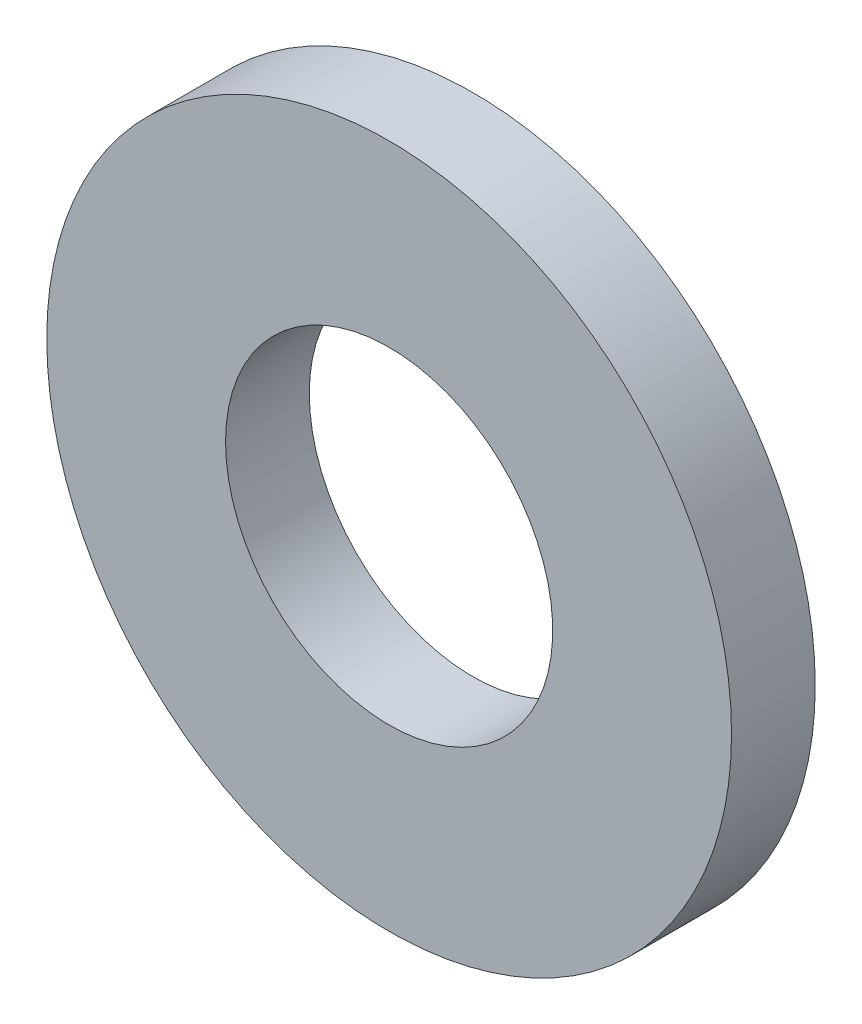
ISO-10303-21;
HEADER;
FILE_DESCRIPTION(('STEP AP214'),'2;1');
FILE_NAME('part.step','',(''),(''),'','','');
FILE_SCHEMA(('AUTOMOTIVE_DESIGN { 1 0 10303 214 1 1 1 1 }'));
ENDSEC;
DATA;
#1=APPLICATION_CONTEXT('core data for automotive mechanical design processes');
#2=APPLICATION_PROTOCOL_DEFINITION('international standard','automotive_design',2000,#1);
#3=PRODUCT_CONTEXT('',#1,'mechanical');
#4=PRODUCT('Part','Part','',(#3));
#5=PRODUCT_RELATED_PRODUCT_CATEGORY('part','',(#4));
#6=PRODUCT_DEFINITION_FORMATION('','',#4);
#7=PRODUCT_DEFINITION_CONTEXT('part definition',#1,'design');
#8=PRODUCT_DEFINITION('design','',#6,#7);
#9=PRODUCT_DEFINITION_SHAPE('','',#8);
#10=(LENGTH_UNIT() NAMED_UNIT(*) SI_UNIT(.MILLI.,.METRE.));
#11=(NAMED_UNIT(*) PLANE_ANGLE_UNIT() SI_UNIT($,.RADIAN.));
#12=(NAMED_UNIT(*) SI_UNIT($,.STERADIAN.) SOLID_ANGLE_UNIT());
#13=UNCERTAINTY_MEASURE_WITH_UNIT(LENGTH_MEASURE(1.E-05),#10,'distance_accuracy_value','');
#14=(GEOMETRIC_REPRESENTATION_CONTEXT(3) GLOBAL_UNCERTAINTY_ASSIGNED_CONTEXT((#13)) GLOBAL_UNIT_ASSIGNED_CONTEXT((#10,
#11,#12)) REPRESENTATION_CONTEXT('',''));
#15=CARTESIAN_POINT('',(0.,0.,0.));
#16=DIRECTION('',(0.,0.,1.));
#17=DIRECTION('',(1.,0.,0.));
#18=AXIS2_PLACEMENT_3D('',#15,#16,#17);
#19=CARTESIAN_POINT('',(0.,0.,0.));
#20=DIRECTION('',(0.,0.,1.));
#21=DIRECTION('',(1.,0.,0.));
#22=AXIS2_PLACEMENT_3D('',#19,#20,#21);
#23=PLANE('',#22);
#24=CARTESIAN_POINT('',(0.,0.,0.));
#25=DIRECTION('',(0.,0.,-1.));
#26=DIRECTION('',(-1.,0.,0.));
#27=AXIS2_PLACEMENT_3D('',#24,#25,#26);
#28=CIRCLE('',#27,2.15);
#29=CARTESIAN_POINT('',(-2.15,0.,0.));
#30=VERTEX_POINT('',#29);
#31=EDGE_CURVE('E27',#30,#30,#28,.F.);
#32=ORIENTED_EDGE('',*,*,#31,.T.);
#33=EDGE_LOOP('',(#32));
#34=FACE_BOUND('',#33,.T.);
#35=CARTESIAN_POINT('',(0.,0.,0.));
#36=DIRECTION('',(0.,0.,-1.));
#37=DIRECTION('',(-1.,0.,0.));
#38=AXIS2_PLACEMENT_3D('',#35,#36,#37);
#39=CIRCLE('',#38,4.5);
#40=CARTESIAN_POINT('',(-4.5,0.,0.));
#41=VERTEX_POINT('',#40);
#42=EDGE_CURVE('E18',#41,#41,#39,.F.);
#43=ORIENTED_EDGE('',*,*,#42,.F.);
#44=EDGE_LOOP('',(#43));
#45=FACE_BOUND('',#44,.T.);
#46=ADVANCED_FACE('F15',(#34,#45),#23,.F.);
#47=CARTESIAN_POINT('',(0.,0.,1.1));
#48=DIRECTION('',(0.,0.,-1.));
#49=DIRECTION('',(-1.,0.,0.));
#50=AXIS2_PLACEMENT_3D('',#47,#48,#49);
#51=CYLINDRICAL_SURFACE('',#50,4.5);
#52=ORIENTED_EDGE('',*,*,#42,.T.);
#53=EDGE_LOOP('',(#52));
#54=FACE_BOUND('',#53,.T.);
#55=CARTESIAN_POINT('',(0.,0.,1.1));
#56=DIRECTION('',(0.,0.,-1.));
#57=DIRECTION('',(-1.,0.,0.));
#58=AXIS2_PLACEMENT_3D('',#55,#56,#57);
#59=CIRCLE('',#58,4.5);
#60=CARTESIAN_POINT('',(-4.5,0.,1.1));
#61=VERTEX_POINT('',#60);
#62=EDGE_CURVE('E22',#61,#61,#59,.F.);
#63=ORIENTED_EDGE('',*,*,#62,.F.);
#64=EDGE_LOOP('',(#63));
#65=FACE_BOUND('',#64,.T.);
#66=ADVANCED_FACE('F35',(#54,#65),#51,.T.);
#67=CARTESIAN_POINT('',(0.,0.,1.1));
#68=DIRECTION('',(0.,0.,-1.));
#69=DIRECTION('',(-1.,0.,0.));
#70=AXIS2_PLACEMENT_3D('',#67,#68,#69);
#71=CYLINDRICAL_SURFACE('',#70,2.15);
#72=CARTESIAN_POINT('',(0.,0.,1.1));
#73=DIRECTION('',(0.,0.,-1.));
#74=DIRECTION('',(-1.,0.,0.));
#75=AXIS2_PLACEMENT_3D('',#72,#73,#74);
#76=CIRCLE('',#75,2.15);
#77=CARTESIAN_POINT('',(-2.15,0.,1.1));
#78=VERTEX_POINT('',#77);
#79=EDGE_CURVE('E10',#78,#78,#76,.T.);
#80=ORIENTED_EDGE('',*,*,#79,.F.);
#81=EDGE_LOOP('',(#80));
#82=FACE_BOUND('',#81,.T.);
#83=ORIENTED_EDGE('',*,*,#31,.F.);
#84=EDGE_LOOP('',(#83));
#85=FACE_BOUND('',#84,.T.);
#86=ADVANCED_FACE('F43',(#82,#85),#71,.F.);
#87=CARTESIAN_POINT('',(0.,0.,1.1));
#88=DIRECTION('',(0.,0.,1.));
#89=DIRECTION('',(1.,0.,0.));
#90=AXIS2_PLACEMENT_3D('',#87,#88,#89);
#91=PLANE('',#90);
#92=ORIENTED_EDGE('',*,*,#79,.T.);
#93=EDGE_LOOP('',(#92));
#94=FACE_BOUND('',#93,.T.);
#95=ORIENTED_EDGE('',*,*,#62,.T.);
#96=EDGE_LOOP('',(#95));
#97=FACE_BOUND('',#96,.T.);
#98=ADVANCED_FACE('F44',(#94,#97),#91,.T.);
#99=CLOSED_SHELL('',(#46,#66,#86,#98));
#100=MANIFOLD_SOLID_BREP('B1',#99);
#101=ADVANCED_BREP_SHAPE_REPRESENTATION('',(#18,#100),#14);
#102=SHAPE_DEFINITION_REPRESENTATION(#9,#101);
ENDSEC;
END-ISO-10303-21;
